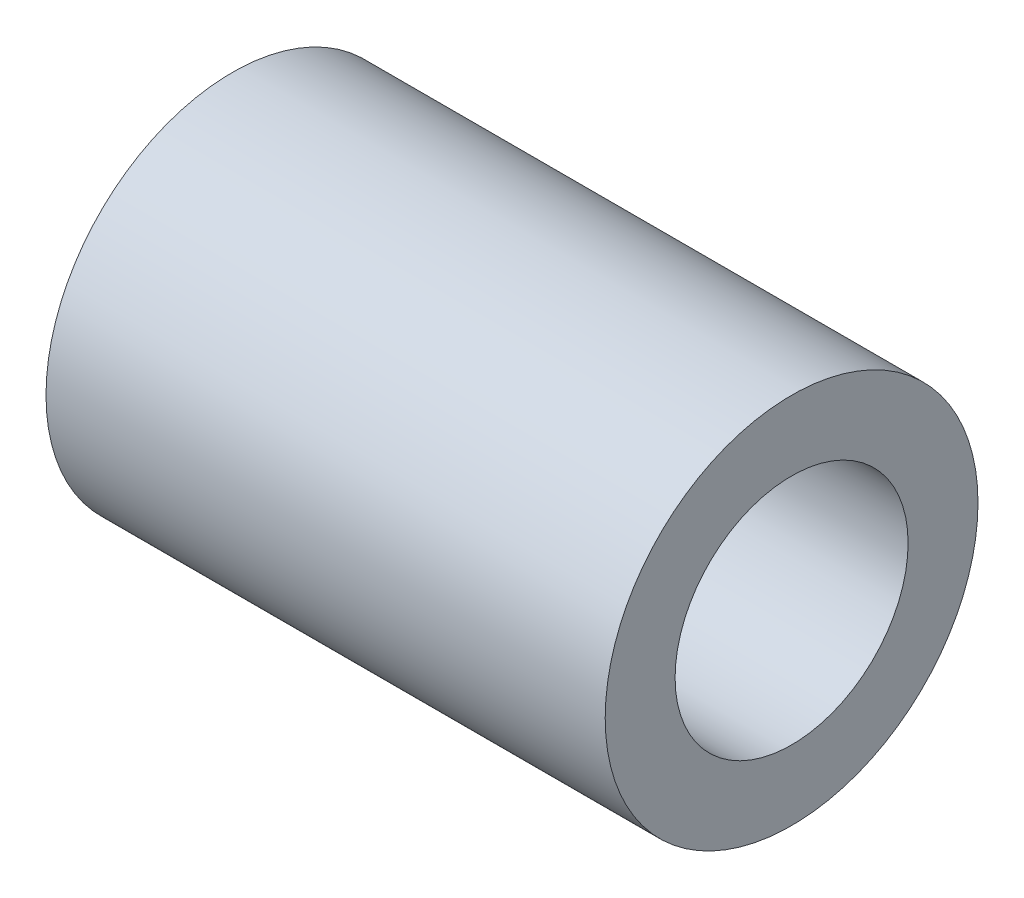
ISO-10303-21;
HEADER;
FILE_DESCRIPTION(('STEP AP214'),'2;1');
FILE_NAME('part.step','',(''),(''),'','','');
FILE_SCHEMA(('AUTOMOTIVE_DESIGN { 1 0 10303 214 1 1 1 1 }'));
ENDSEC;
DATA;
#1=APPLICATION_CONTEXT('core data for automotive mechanical design processes');
#2=APPLICATION_PROTOCOL_DEFINITION('international standard','automotive_design',2000,#1);
#3=PRODUCT_CONTEXT('',#1,'mechanical');
#4=PRODUCT('Part','Part','',(#3));
#5=PRODUCT_RELATED_PRODUCT_CATEGORY('part','',(#4));
#6=PRODUCT_DEFINITION_FORMATION('','',#4);
#7=PRODUCT_DEFINITION_CONTEXT('part definition',#1,'design');
#8=PRODUCT_DEFINITION('design','',#6,#7);
#9=PRODUCT_DEFINITION_SHAPE('','',#8);
#10=(LENGTH_UNIT() NAMED_UNIT(*) SI_UNIT(.MILLI.,.METRE.));
#11=(NAMED_UNIT(*) PLANE_ANGLE_UNIT() SI_UNIT($,.RADIAN.));
#12=(NAMED_UNIT(*) SI_UNIT($,.STERADIAN.) SOLID_ANGLE_UNIT());
#13=UNCERTAINTY_MEASURE_WITH_UNIT(LENGTH_MEASURE(1.E-05),#10,'distance_accuracy_value','');
#14=(GEOMETRIC_REPRESENTATION_CONTEXT(3) GLOBAL_UNCERTAINTY_ASSIGNED_CONTEXT((#13)) GLOBAL_UNIT_ASSIGNED_CONTEXT((#10,
#11,#12)) REPRESENTATION_CONTEXT('',''));
#15=CARTESIAN_POINT('',(0.,0.,0.));
#16=DIRECTION('',(0.,0.,1.));
#17=DIRECTION('',(1.,0.,0.));
#18=AXIS2_PLACEMENT_3D('',#15,#16,#17);
#19=CARTESIAN_POINT('',(6.,0.,0.));
#20=DIRECTION('',(1.,0.,0.));
#21=DIRECTION('',(0.,0.,-1.));
#22=AXIS2_PLACEMENT_3D('',#19,#20,#21);
#23=CYLINDRICAL_SURFACE('',#22,1.25);
#24=CARTESIAN_POINT('',(0.,0.,0.));
#25=DIRECTION('',(1.,0.,0.));
#26=DIRECTION('',(0.,0.,-1.));
#27=AXIS2_PLACEMENT_3D('',#24,#25,#26);
#28=CIRCLE('',#27,1.25);
#29=CARTESIAN_POINT('',(0.,0.,-1.25));
#30=VERTEX_POINT('',#29);
#31=EDGE_CURVE('E27',#30,#30,#28,.F.);
#32=ORIENTED_EDGE('',*,*,#31,.T.);
#33=EDGE_LOOP('',(#32));
#34=FACE_BOUND('',#33,.T.);
#35=CARTESIAN_POINT('',(6.,0.,0.));
#36=DIRECTION('',(1.,0.,0.));
#37=DIRECTION('',(0.,0.,-1.));
#38=AXIS2_PLACEMENT_3D('',#35,#36,#37);
#39=CIRCLE('',#38,1.25);
#40=CARTESIAN_POINT('',(6.,0.,-1.25));
#41=VERTEX_POINT('',#40);
#42=EDGE_CURVE('E18',#41,#41,#39,.F.);
#43=ORIENTED_EDGE('',*,*,#42,.F.);
#44=EDGE_LOOP('',(#43));
#45=FACE_BOUND('',#44,.T.);
#46=ADVANCED_FACE('F15',(#34,#45),#23,.F.);
#47=CARTESIAN_POINT('',(6.,0.,0.));
#48=DIRECTION('',(1.,0.,0.));
#49=DIRECTION('',(0.,0.,-1.));
#50=AXIS2_PLACEMENT_3D('',#47,#48,#49);
#51=PLANE('',#50);
#52=CARTESIAN_POINT('',(6.,0.,0.));
#53=DIRECTION('',(-1.,0.,0.));
#54=DIRECTION('',(0.,0.,1.));
#55=AXIS2_PLACEMENT_3D('',#52,#53,#54);
#56=CIRCLE('',#55,2.);
#57=CARTESIAN_POINT('',(6.,0.,2.));
#58=VERTEX_POINT('',#57);
#59=EDGE_CURVE('E22',#58,#58,#56,.T.);
#60=ORIENTED_EDGE('',*,*,#59,.F.);
#61=EDGE_LOOP('',(#60));
#62=FACE_BOUND('',#61,.T.);
#63=ORIENTED_EDGE('',*,*,#42,.T.);
#64=EDGE_LOOP('',(#63));
#65=FACE_BOUND('',#64,.T.);
#66=ADVANCED_FACE('F35',(#62,#65),#51,.T.);
#67=CARTESIAN_POINT('',(0.,0.,0.));
#68=DIRECTION('',(1.,0.,0.));
#69=DIRECTION('',(0.,0.,-1.));
#70=AXIS2_PLACEMENT_3D('',#67,#68,#69);
#71=PLANE('',#70);
#72=CARTESIAN_POINT('',(0.,0.,0.));
#73=DIRECTION('',(-1.,0.,0.));
#74=DIRECTION('',(0.,0.,1.));
#75=AXIS2_PLACEMENT_3D('',#72,#73,#74);
#76=CIRCLE('',#75,2.);
#77=CARTESIAN_POINT('',(0.,0.,2.));
#78=VERTEX_POINT('',#77);
#79=EDGE_CURVE('E10',#78,#78,#76,.F.);
#80=ORIENTED_EDGE('',*,*,#79,.F.);
#81=EDGE_LOOP('',(#80));
#82=FACE_BOUND('',#81,.T.);
#83=ORIENTED_EDGE('',*,*,#31,.F.);
#84=EDGE_LOOP('',(#83));
#85=FACE_BOUND('',#84,.T.);
#86=ADVANCED_FACE('F42',(#82,#85),#71,.F.);
#87=CARTESIAN_POINT('',(6.,0.,0.));
#88=DIRECTION('',(-1.,0.,0.));
#89=DIRECTION('',(0.,0.,1.));
#90=AXIS2_PLACEMENT_3D('',#87,#88,#89);
#91=CYLINDRICAL_SURFACE('',#90,2.);
#92=ORIENTED_EDGE('',*,*,#79,.T.);
#93=EDGE_LOOP('',(#92));
#94=FACE_BOUND('',#93,.T.);
#95=ORIENTED_EDGE('',*,*,#59,.T.);
#96=EDGE_LOOP('',(#95));
#97=FACE_BOUND('',#96,.T.);
#98=ADVANCED_FACE('F44',(#94,#97),#91,.T.);
#99=CLOSED_SHELL('',(#46,#66,#86,#98));
#100=MANIFOLD_SOLID_BREP('B1',#99);
#101=ADVANCED_BREP_SHAPE_REPRESENTATION('',(#18,#100),#14);
#102=SHAPE_DEFINITION_REPRESENTATION(#9,#101);
ENDSEC;
END-ISO-10303-21;
